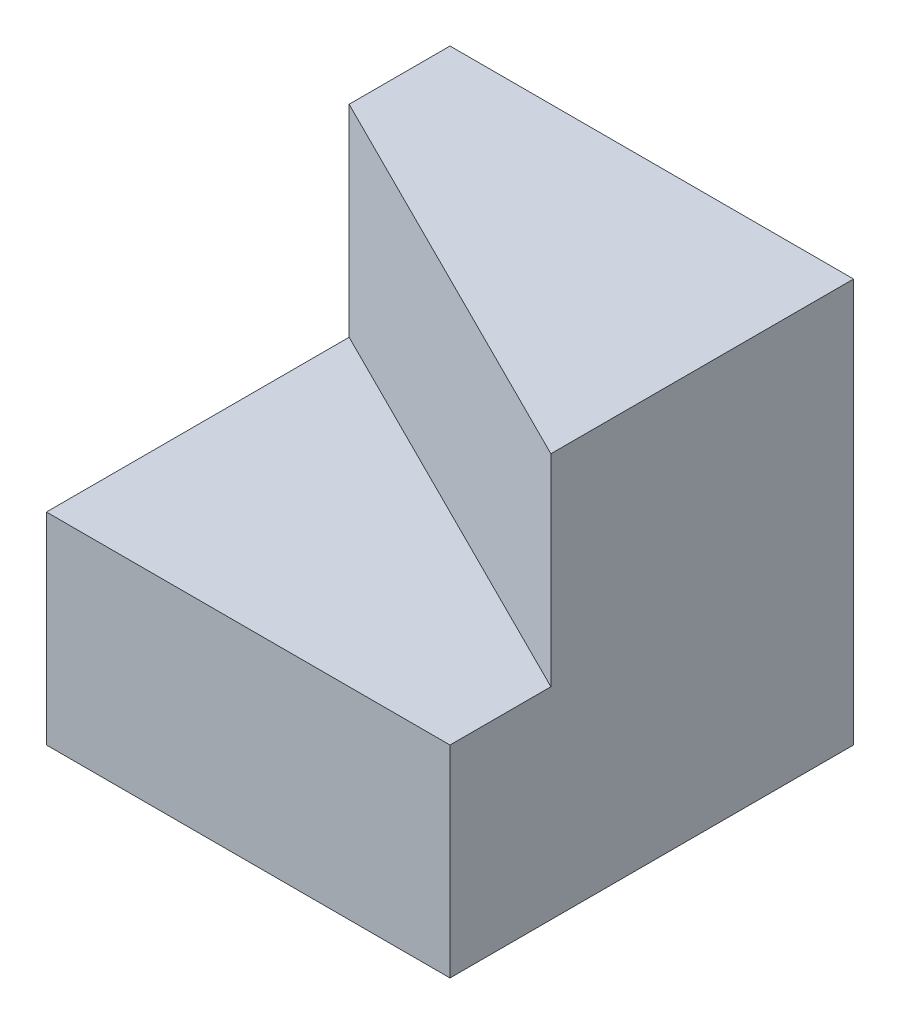
ISO-10303-21;
HEADER;
FILE_DESCRIPTION(('STEP AP214'),'2;1');
FILE_NAME('part.step','',(''),(''),'','','');
FILE_SCHEMA(('AUTOMOTIVE_DESIGN { 1 0 10303 214 1 1 1 1 }'));
ENDSEC;
DATA;
#1=APPLICATION_CONTEXT('core data for automotive mechanical design processes');
#2=APPLICATION_PROTOCOL_DEFINITION('international standard','automotive_design',2000,#1);
#3=PRODUCT_CONTEXT('',#1,'mechanical');
#4=PRODUCT('Part','Part','',(#3));
#5=PRODUCT_RELATED_PRODUCT_CATEGORY('part','',(#4));
#6=PRODUCT_DEFINITION_FORMATION('','',#4);
#7=PRODUCT_DEFINITION_CONTEXT('part definition',#1,'design');
#8=PRODUCT_DEFINITION('design','',#6,#7);
#9=PRODUCT_DEFINITION_SHAPE('','',#8);
#10=(LENGTH_UNIT() NAMED_UNIT(*) SI_UNIT(.MILLI.,.METRE.));
#11=(NAMED_UNIT(*) PLANE_ANGLE_UNIT() SI_UNIT($,.RADIAN.));
#12=(NAMED_UNIT(*) SI_UNIT($,.STERADIAN.) SOLID_ANGLE_UNIT());
#13=UNCERTAINTY_MEASURE_WITH_UNIT(LENGTH_MEASURE(1.E-05),#10,'distance_accuracy_value','');
#14=(GEOMETRIC_REPRESENTATION_CONTEXT(3) GLOBAL_UNCERTAINTY_ASSIGNED_CONTEXT((#13)) GLOBAL_UNIT_ASSIGNED_CONTEXT((#10,
#11,#12)) REPRESENTATION_CONTEXT('',''));
#15=CARTESIAN_POINT('',(0.,0.,0.));
#16=DIRECTION('',(0.,0.,1.));
#17=DIRECTION('',(1.,0.,0.));
#18=AXIS2_PLACEMENT_3D('',#15,#16,#17);
#19=CARTESIAN_POINT('',(0.,0.,40.));
#20=DIRECTION('',(1.,0.,0.));
#21=DIRECTION('',(0.,0.,-1.));
#22=AXIS2_PLACEMENT_3D('',#19,#20,#21);
#23=PLANE('',#22);
#24=DIRECTION('',(0.,-1.,0.));
#25=VECTOR('',#24,1.);
#26=CARTESIAN_POINT('',(0.,0.,40.));
#27=LINE('',#26,#25);
#28=CARTESIAN_POINT('',(0.,20.,40.));
#29=VERTEX_POINT('',#28);
#30=CARTESIAN_POINT('',(0.,0.,40.));
#31=VERTEX_POINT('',#30);
#32=EDGE_CURVE('E107',#29,#31,#27,.T.);
#33=ORIENTED_EDGE('',*,*,#32,.F.);
#34=DIRECTION('',(0.,0.,1.));
#35=VECTOR('',#34,1.);
#36=CARTESIAN_POINT('',(0.,20.,10.));
#37=LINE('',#36,#35);
#38=CARTESIAN_POINT('',(0.,20.,10.));
#39=VERTEX_POINT('',#38);
#40=EDGE_CURVE('E103',#39,#29,#37,.T.);
#41=ORIENTED_EDGE('',*,*,#40,.F.);
#42=DIRECTION('',(0.,1.,0.));
#43=VECTOR('',#42,1.);
#44=CARTESIAN_POINT('',(0.,40.,10.));
#45=LINE('',#44,#43);
#46=CARTESIAN_POINT('',(0.,40.,10.));
#47=VERTEX_POINT('',#46);
#48=EDGE_CURVE('E96',#39,#47,#45,.T.);
#49=ORIENTED_EDGE('',*,*,#48,.T.);
#50=DIRECTION('',(0.,0.,-1.));
#51=VECTOR('',#50,1.);
#52=CARTESIAN_POINT('',(0.,40.,10.));
#53=LINE('',#52,#51);
#54=CARTESIAN_POINT('',(0.,40.,0.));
#55=VERTEX_POINT('',#54);
#56=EDGE_CURVE('E113',#47,#55,#53,.T.);
#57=ORIENTED_EDGE('',*,*,#56,.T.);
#58=DIRECTION('',(0.,-1.,0.));
#59=VECTOR('',#58,1.);
#60=CARTESIAN_POINT('',(0.,0.,0.));
#61=LINE('',#60,#59);
#62=CARTESIAN_POINT('',(0.,0.,0.));
#63=VERTEX_POINT('',#62);
#64=EDGE_CURVE('E60',#55,#63,#61,.T.);
#65=ORIENTED_EDGE('',*,*,#64,.T.);
#66=DIRECTION('',(0.,0.,-1.));
#67=VECTOR('',#66,1.);
#68=CARTESIAN_POINT('',(0.,0.,40.));
#69=LINE('',#68,#67);
#70=EDGE_CURVE('E11',#31,#63,#69,.T.);
#71=ORIENTED_EDGE('',*,*,#70,.F.);
#72=EDGE_LOOP('',(#33,#41,#49,#57,#65,#71));
#73=FACE_BOUND('',#72,.T.);
#74=ADVANCED_FACE('F33',(#73),#23,.F.);
#75=CARTESIAN_POINT('',(0.,0.,40.));
#76=DIRECTION('',(0.,1.,0.));
#77=DIRECTION('',(0.,0.,1.));
#78=AXIS2_PLACEMENT_3D('',#75,#76,#77);
#79=PLANE('',#78);
#80=DIRECTION('',(1.,0.,0.));
#81=VECTOR('',#80,1.);
#82=CARTESIAN_POINT('',(0.,0.,0.));
#83=LINE('',#82,#81);
#84=CARTESIAN_POINT('',(40.,0.,0.));
#85=VERTEX_POINT('',#84);
#86=EDGE_CURVE('E122',#63,#85,#83,.T.);
#87=ORIENTED_EDGE('',*,*,#86,.T.);
#88=DIRECTION('',(0.,0.,-1.));
#89=VECTOR('',#88,1.);
#90=CARTESIAN_POINT('',(40.,0.,40.));
#91=LINE('',#90,#89);
#92=CARTESIAN_POINT('',(40.,0.,40.));
#93=VERTEX_POINT('',#92);
#94=EDGE_CURVE('E41',#93,#85,#91,.T.);
#95=ORIENTED_EDGE('',*,*,#94,.F.);
#96=DIRECTION('',(1.,0.,0.));
#97=VECTOR('',#96,1.);
#98=CARTESIAN_POINT('',(0.,0.,40.));
#99=LINE('',#98,#97);
#100=EDGE_CURVE('E49',#31,#93,#99,.T.);
#101=ORIENTED_EDGE('',*,*,#100,.F.);
#102=ORIENTED_EDGE('',*,*,#70,.T.);
#103=EDGE_LOOP('',(#87,#95,#101,#102));
#104=FACE_BOUND('',#103,.T.);
#105=ADVANCED_FACE('F143',(#104),#79,.F.);
#106=CARTESIAN_POINT('',(40.,0.,40.));
#107=DIRECTION('',(-1.,0.,0.));
#108=DIRECTION('',(0.,0.,1.));
#109=AXIS2_PLACEMENT_3D('',#106,#107,#108);
#110=PLANE('',#109);
#111=DIRECTION('',(0.,1.,0.));
#112=VECTOR('',#111,1.);
#113=CARTESIAN_POINT('',(40.,0.,0.));
#114=LINE('',#113,#112);
#115=CARTESIAN_POINT('',(40.,40.,0.));
#116=VERTEX_POINT('',#115);
#117=EDGE_CURVE('E116',#85,#116,#114,.T.);
#118=ORIENTED_EDGE('',*,*,#117,.T.);
#119=DIRECTION('',(0.,0.,-1.));
#120=VECTOR('',#119,1.);
#121=CARTESIAN_POINT('',(40.,40.,40.));
#122=LINE('',#121,#120);
#123=CARTESIAN_POINT('',(40.,40.,30.));
#124=VERTEX_POINT('',#123);
#125=EDGE_CURVE('E120',#124,#116,#122,.T.);
#126=ORIENTED_EDGE('',*,*,#125,.F.);
#127=DIRECTION('',(0.,1.,0.));
#128=VECTOR('',#127,1.);
#129=CARTESIAN_POINT('',(40.,20.,30.));
#130=LINE('',#129,#128);
#131=CARTESIAN_POINT('',(40.,20.,30.));
#132=VERTEX_POINT('',#131);
#133=EDGE_CURVE('E83',#132,#124,#130,.T.);
#134=ORIENTED_EDGE('',*,*,#133,.F.);
#135=DIRECTION('',(0.,0.,-1.));
#136=VECTOR('',#135,1.);
#137=CARTESIAN_POINT('',(40.,20.,40.));
#138=LINE('',#137,#136);
#139=CARTESIAN_POINT('',(40.,20.,40.));
#140=VERTEX_POINT('',#139);
#141=EDGE_CURVE('E104',#140,#132,#138,.T.);
#142=ORIENTED_EDGE('',*,*,#141,.F.);
#143=DIRECTION('',(0.,1.,0.));
#144=VECTOR('',#143,1.);
#145=CARTESIAN_POINT('',(40.,0.,40.));
#146=LINE('',#145,#144);
#147=EDGE_CURVE('E118',#93,#140,#146,.T.);
#148=ORIENTED_EDGE('',*,*,#147,.F.);
#149=ORIENTED_EDGE('',*,*,#94,.T.);
#150=EDGE_LOOP('',(#118,#126,#134,#142,#148,#149));
#151=FACE_BOUND('',#150,.T.);
#152=ADVANCED_FACE('F130',(#151),#110,.F.);
#153=CARTESIAN_POINT('',(0.,40.,40.));
#154=DIRECTION('',(0.,-1.,0.));
#155=DIRECTION('',(0.,0.,-1.));
#156=AXIS2_PLACEMENT_3D('',#153,#154,#155);
#157=PLANE('',#156);
#158=ORIENTED_EDGE('',*,*,#125,.T.);
#159=DIRECTION('',(1.,0.,0.));
#160=VECTOR('',#159,1.);
#161=CARTESIAN_POINT('',(0.,40.,0.));
#162=LINE('',#161,#160);
#163=EDGE_CURVE('E137',#55,#116,#162,.T.);
#164=ORIENTED_EDGE('',*,*,#163,.F.);
#165=ORIENTED_EDGE('',*,*,#56,.F.);
#166=DIRECTION('',(-0.894427190999916,0.,-0.447213595499958));
#167=VECTOR('',#166,1.);
#168=CARTESIAN_POINT('',(40.,40.,30.));
#169=LINE('',#168,#167);
#170=EDGE_CURVE('E89',#124,#47,#169,.T.);
#171=ORIENTED_EDGE('',*,*,#170,.F.);
#172=EDGE_LOOP('',(#158,#164,#165,#171));
#173=FACE_BOUND('',#172,.T.);
#174=ADVANCED_FACE('F141',(#173),#157,.F.);
#175=CARTESIAN_POINT('',(0.,0.,40.));
#176=DIRECTION('',(0.,0.,-1.));
#177=DIRECTION('',(-1.,0.,0.));
#178=AXIS2_PLACEMENT_3D('',#175,#176,#177);
#179=PLANE('',#178);
#180=ORIENTED_EDGE('',*,*,#147,.T.);
#181=DIRECTION('',(1.,0.,0.));
#182=VECTOR('',#181,1.);
#183=CARTESIAN_POINT('',(0.,20.,40.));
#184=LINE('',#183,#182);
#185=EDGE_CURVE('E70',#29,#140,#184,.T.);
#186=ORIENTED_EDGE('',*,*,#185,.F.);
#187=ORIENTED_EDGE('',*,*,#32,.T.);
#188=ORIENTED_EDGE('',*,*,#100,.T.);
#189=EDGE_LOOP('',(#180,#186,#187,#188));
#190=FACE_BOUND('',#189,.T.);
#191=ADVANCED_FACE('F142',(#190),#179,.F.);
#192=CARTESIAN_POINT('',(0.,0.,0.));
#193=DIRECTION('',(0.,0.,-1.));
#194=DIRECTION('',(-1.,0.,0.));
#195=AXIS2_PLACEMENT_3D('',#192,#193,#194);
#196=PLANE('',#195);
#197=ORIENTED_EDGE('',*,*,#64,.F.);
#198=ORIENTED_EDGE('',*,*,#163,.T.);
#199=ORIENTED_EDGE('',*,*,#117,.F.);
#200=ORIENTED_EDGE('',*,*,#86,.F.);
#201=EDGE_LOOP('',(#197,#198,#199,#200));
#202=FACE_BOUND('',#201,.T.);
#203=ADVANCED_FACE('F135',(#202),#196,.T.);
#204=CARTESIAN_POINT('',(40.,20.,30.));
#205=DIRECTION('',(0.447213595499958,0.,-0.894427190999916));
#206=DIRECTION('',(-0.894427190999916,0.,-0.447213595499958));
#207=AXIS2_PLACEMENT_3D('',#204,#205,#206);
#208=PLANE('',#207);
#209=ORIENTED_EDGE('',*,*,#170,.T.);
#210=ORIENTED_EDGE('',*,*,#48,.F.);
#211=DIRECTION('',(-0.894427190999916,0.,-0.447213595499958));
#212=VECTOR('',#211,1.);
#213=CARTESIAN_POINT('',(40.,20.,30.));
#214=LINE('',#213,#212);
#215=EDGE_CURVE('E99',#132,#39,#214,.T.);
#216=ORIENTED_EDGE('',*,*,#215,.F.);
#217=ORIENTED_EDGE('',*,*,#133,.T.);
#218=EDGE_LOOP('',(#209,#210,#216,#217));
#219=FACE_BOUND('',#218,.T.);
#220=ADVANCED_FACE('F98',(#219),#208,.F.);
#221=CARTESIAN_POINT('',(0.,20.,0.));
#222=DIRECTION('',(0.,-1.,0.));
#223=DIRECTION('',(0.,0.,-1.));
#224=AXIS2_PLACEMENT_3D('',#221,#222,#223);
#225=PLANE('',#224);
#226=ORIENTED_EDGE('',*,*,#141,.T.);
#227=ORIENTED_EDGE('',*,*,#215,.T.);
#228=ORIENTED_EDGE('',*,*,#40,.T.);
#229=ORIENTED_EDGE('',*,*,#185,.T.);
#230=EDGE_LOOP('',(#226,#227,#228,#229));
#231=FACE_BOUND('',#230,.T.);
#232=ADVANCED_FACE('F102',(#231),#225,.F.);
#233=CLOSED_SHELL('',(#74,#105,#152,#174,#191,#203,#220,#232));
#234=MANIFOLD_SOLID_BREP('B2',#233);
#235=ADVANCED_BREP_SHAPE_REPRESENTATION('',(#18,#234),#14);
#236=SHAPE_DEFINITION_REPRESENTATION(#9,#235);
ENDSEC;
END-ISO-10303-21;
